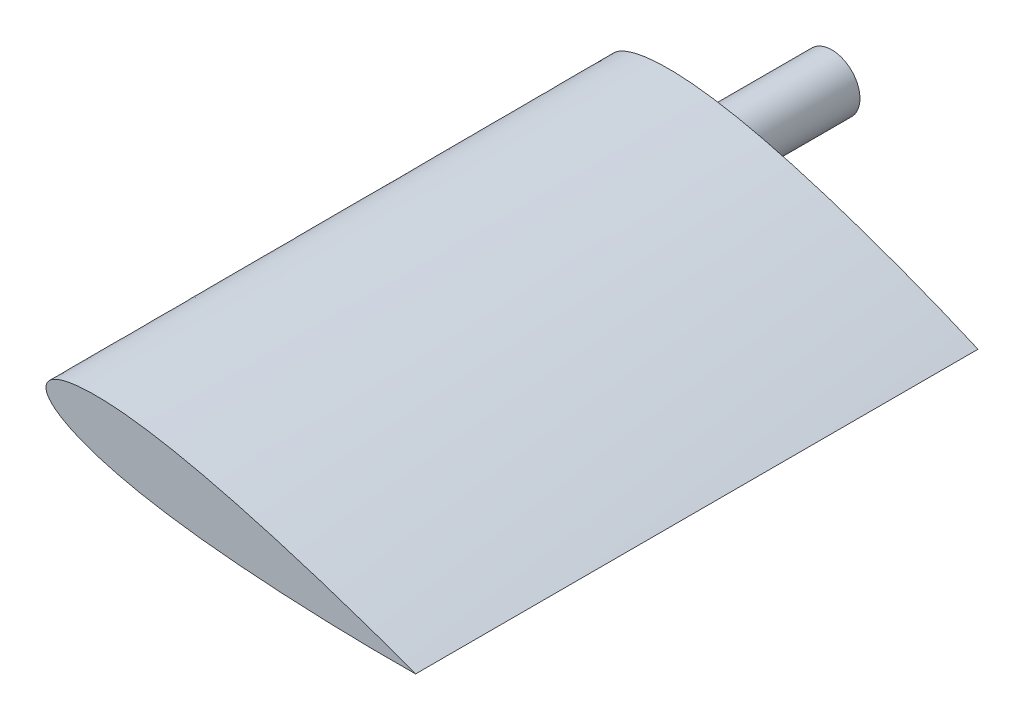
ISO-10303-21;
HEADER;
FILE_DESCRIPTION(('STEP AP214'),'2;1');
FILE_NAME('part.step','',(''),(''),'','','');
FILE_SCHEMA(('AUTOMOTIVE_DESIGN { 1 0 10303 214 1 1 1 1 }'));
ENDSEC;
DATA;
#1=APPLICATION_CONTEXT('core data for automotive mechanical design processes');
#2=APPLICATION_PROTOCOL_DEFINITION('international standard','automotive_design',2000,#1);
#3=PRODUCT_CONTEXT('',#1,'mechanical');
#4=PRODUCT('Part','Part','',(#3));
#5=PRODUCT_RELATED_PRODUCT_CATEGORY('part','',(#4));
#6=PRODUCT_DEFINITION_FORMATION('','',#4);
#7=PRODUCT_DEFINITION_CONTEXT('part definition',#1,'design');
#8=PRODUCT_DEFINITION('design','',#6,#7);
#9=PRODUCT_DEFINITION_SHAPE('','',#8);
#10=(LENGTH_UNIT() NAMED_UNIT(*) SI_UNIT(.MILLI.,.METRE.));
#11=(NAMED_UNIT(*) PLANE_ANGLE_UNIT() SI_UNIT($,.RADIAN.));
#12=(NAMED_UNIT(*) SI_UNIT($,.STERADIAN.) SOLID_ANGLE_UNIT());
#13=UNCERTAINTY_MEASURE_WITH_UNIT(LENGTH_MEASURE(1.E-05),#10,'distance_accuracy_value','');
#14=(GEOMETRIC_REPRESENTATION_CONTEXT(3) GLOBAL_UNCERTAINTY_ASSIGNED_CONTEXT((#13)) GLOBAL_UNIT_ASSIGNED_CONTEXT((#10,
#11,#12)) REPRESENTATION_CONTEXT('',''));
#15=CARTESIAN_POINT('',(0.,0.,0.));
#16=DIRECTION('',(0.,0.,1.));
#17=DIRECTION('',(1.,0.,0.));
#18=AXIS2_PLACEMENT_3D('',#15,#16,#17);
#19=CARTESIAN_POINT('',(313.547400110692,-57.174394458931,0.));
#20=DIRECTION('',(0.,0.,-1.));
#21=DIRECTION('',(-0.984807753012208,0.173648177666931,0.));
#22=AXIS2_PLACEMENT_3D('',#19,#20,#21);
#23=PLANE('',#22);
#24=CARTESIAN_POINT('',(202.028157373327,23.1819604238643,0.));
#25=DIRECTION('',(0.,0.,-1.));
#26=DIRECTION('',(-0.984807753012208,0.173648177666931,0.));
#27=AXIS2_PLACEMENT_3D('',#24,#25,#26);
#28=CIRCLE('',#27,50.);
#29=CARTESIAN_POINT('',(152.787769722716,31.8643693072108,0.));
#30=VERTEX_POINT('',#29);
#31=EDGE_CURVE('E96',#30,#30,#28,.T.);
#32=ORIENTED_EDGE('',*,*,#31,.F.);
#33=EDGE_LOOP('',(#32));
#34=FACE_BOUND('',#33,.T.);
#35=CARTESIAN_POINT('',(5.0666067708914,57.9115959572867,0.));
#36=CARTESIAN_POINT('',(4.75000358816037,56.1204386306563,0.));
#37=CARTESIAN_POINT('',(4.45652546687087,52.489358454994,0.));
#38=CARTESIAN_POINT('',(5.05191566782038,47.0479784036478,0.));
#39=CARTESIAN_POINT('',(6.58340072404875,41.8028813902483,0.));
#40=CARTESIAN_POINT('',(8.87244931250566,36.8457455571666,0.));
#41=CARTESIAN_POINT('',(11.7457186136554,32.2080177348289,0.));
#42=CARTESIAN_POINT('',(15.0641341744214,27.8817430967198,0.));
#43=CARTESIAN_POINT('',(18.7188700505766,23.8389440245324,0.));
#44=CARTESIAN_POINT('',(22.642947629858,20.0525926434712,0.));
#45=CARTESIAN_POINT('',(26.7693883000024,16.4956610787409,0.));
#46=CARTESIAN_POINT('',(31.0650945500276,13.1445234240756,0.));
#47=CARTESIAN_POINT('',(35.4969688689515,9.97555377320941,0.));
#48=CARTESIAN_POINT('',(41.5595930737063,5.97173158064968,0.));
#49=CARTESIAN_POINT('',(49.3729223306139,1.34204886268438,0.));
#50=CARTESIAN_POINT('',(59.0277387937009,-3.71320136850407,0.));
#51=CARTESIAN_POINT('',(68.8941626666754,-8.33849155951117,0.));
#52=CARTESIAN_POINT('',(78.926828422375,-12.5910864328743,0.));
#53=CARTESIAN_POINT('',(89.091490855078,-16.5145508241901,0.));
#54=CARTESIAN_POINT('',(99.36536626331,-20.144120040309,0.));
#55=CARTESIAN_POINT('',(109.727606901045,-23.5094518071365,0.));
#56=CARTESIAN_POINT('',(120.166014121485,-26.6347820025642,0.));
#57=CARTESIAN_POINT('',(130.665295789642,-29.5407678607339,0.));
#58=CARTESIAN_POINT('',(141.221494854735,-32.2462376955715,0.));
#59=CARTESIAN_POINT('',(151.820273064177,-34.7664293469896,0.));
#60=CARTESIAN_POINT('',(162.457997897433,-37.1146974894133,0.));
#61=CARTESIAN_POINT('',(173.131036833968,-39.3043967972676,0.));
#62=CARTESIAN_POINT('',(187.401516942255,-42.0263580509416,0.));
#63=CARTESIAN_POINT('',(205.300437542814,-45.084089866463,0.));
#64=CARTESIAN_POINT('',(226.857296262129,-48.2716417544606,0.));
#65=CARTESIAN_POINT('',(248.471659173799,-51.0336902977323,0.));
#66=CARTESIAN_POINT('',(270.131103449499,-53.4194991857202,0.));
#67=CARTESIAN_POINT('',(291.824461267508,-55.4696073332529,0.));
#68=CARTESIAN_POINT('',(313.544094756513,-57.219514984784,0.));
#69=CARTESIAN_POINT('',(335.283636317038,-58.6986798757468,0.));
#70=CARTESIAN_POINT('',(357.038650149282,-59.932538943737,0.));
#71=CARTESIAN_POINT('',(378.804794627028,-60.9424564549858,0.));
#72=CARTESIAN_POINT('',(400.580067973628,-61.7461325424527,0.));
#73=CARTESIAN_POINT('',(422.360458385054,-62.3580469133347,0.));
#74=CARTESIAN_POINT('',(444.147271263891,-62.7897434644158,0.));
#75=CARTESIAN_POINT('',(465.932743404275,-63.0499693131686,0.));
#76=CARTESIAN_POINT('',(487.726865329098,-63.144788310054,0.));
#77=CARTESIAN_POINT('',(509.50774249008,-63.078216835237,0.));
#78=CARTESIAN_POINT('',(531.312978943719,-62.8509884427372,0.));
#79=CARTESIAN_POINT('',(553.068432347847,-62.4639425472107,0.));
#80=CARTESIAN_POINT('',(574.909251200701,-61.9108163534676,0.));
#81=CARTESIAN_POINT('',(592.969226873889,-61.3135674524085,0.));
#82=CARTESIAN_POINT('',(607.548218071428,-60.7440668272987,0.));
#83=CARTESIAN_POINT('',(618.428042725409,-60.2731604246947,0.));
#84=CARTESIAN_POINT('',(629.269024010586,-59.759498376123,0.));
#85=CARTESIAN_POINT('',(640.256906166686,-59.1893860031201,0.));
#86=CARTESIAN_POINT('',(650.846693638105,-58.5953215211944,0.));
#87=CARTESIAN_POINT('',(658.634994095804,-58.1202704883738,0.));
#88=CARTESIAN_POINT('',(661.933378030041,-57.9117385465572,0.));
#89=B_SPLINE_CURVE_WITH_KNOTS('',3,(#35,#36,#37,#38,#39,#40,#41,#42,#43,#44,#45,#46,#47,#48,#49,
#50,#51,#52,#53,#54,#55,#56,#57,#58,#59,#60,#61,#62,#63,#64,#65,#66,#67,#68,#69,#70,#71,#72,#73,
#74,#75,#76,#77,#78,#79,#80,#81,#82,#83,#84,#85,#86,#87,#88),.UNSPECIFIED.,.F.,.F.,(4,1,1,1,1,1,
1,1,1,1,1,1,1,1,1,1,1,1,1,1,1,1,1,1,1,1,1,1,1,1,1,1,1,1,1,1,1,1,1,1,1,1,1,1,1,1,1,1,1,1,1,4),
(0.,0.0078125,0.015625,0.0234375,0.03125,0.0390625,0.046875,0.0546875,0.0625,0.0703125,0.078125,
0.0859375,0.09375,0.109375,0.125,0.140625,0.15625,0.171875,0.1875,0.203125,0.21875,0.234375,
0.25,0.265625,0.28125,0.296875,0.3125,0.34375,0.375,0.40625,0.4375,0.46875,0.5,0.53125,0.5625,
0.59375,0.625,0.65625,0.6875,0.71875,0.75,0.78125,0.8125,0.84375,0.875,0.90625,0.921875,0.9375,
0.953125,0.96875,0.984375,1.),.UNSPECIFIED.);
#90=CARTESIAN_POINT('',(5.0666067708914,57.9115959572867,0.));
#91=VERTEX_POINT('',#90);
#92=CARTESIAN_POINT('',(661.933378030041,-57.9117385465573,0.));
#93=VERTEX_POINT('',#92);
#94=EDGE_CURVE('E48',#91,#93,#89,.T.);
#95=ORIENTED_EDGE('',*,*,#94,.F.);
#96=CARTESIAN_POINT('',(661.933378030041,-57.9117385465574,0.));
#97=CARTESIAN_POINT('',(658.905233111148,-56.5876688737035,0.));
#98=CARTESIAN_POINT('',(651.749149836963,-53.4775328355619,0.));
#99=CARTESIAN_POINT('',(642.001044636683,-49.2973108025141,0.));
#100=CARTESIAN_POINT('',(631.871067754876,-45.0036212639001,0.));
#101=CARTESIAN_POINT('',(621.859120861425,-40.812906323977,0.));
#102=CARTESIAN_POINT('',(611.796786641441,-36.6494308175617,0.));
#103=CARTESIAN_POINT('',(598.297761062526,-31.1303487892266,0.));
#104=CARTESIAN_POINT('',(581.521814668085,-24.3884729093357,0.));
#105=CARTESIAN_POINT('',(561.192347333142,-16.4006977086737,0.));
#106=CARTESIAN_POINT('',(540.878796691945,-8.59521050167727,0.));
#107=CARTESIAN_POINT('',(520.467631270086,-0.924376775729138,0.));
#108=CARTESIAN_POINT('',(500.02237908007,6.58794532575718,0.));
#109=CARTESIAN_POINT('',(479.51054541612,13.9527314489505,0.));
#110=CARTESIAN_POINT('',(458.949683813102,21.1593493613073,0.));
#111=CARTESIAN_POINT('',(438.329240178968,28.2051741644773,0.));
#112=CARTESIAN_POINT('',(417.653022415049,35.0795166119824,0.));
#113=CARTESIAN_POINT('',(396.916113870649,41.7718798142035,0.));
#114=CARTESIAN_POINT('',(376.117201782436,48.2673329569814,0.));
#115=CARTESIAN_POINT('',(355.252178058308,54.5485350466229,0.));
#116=CARTESIAN_POINT('',(334.317785172344,60.5939368342467,0.));
#117=CARTESIAN_POINT('',(313.309500165218,66.3781137750711,0.));
#118=CARTESIAN_POINT('',(292.223240103197,71.8712065887761,0.));
#119=CARTESIAN_POINT('',(271.054012584372,77.0372480125403,0.));
#120=CARTESIAN_POINT('',(249.798501286547,81.8343151717546,0.));
#121=CARTESIAN_POINT('',(228.451433472985,86.2118823785855,0.));
#122=CARTESIAN_POINT('',(210.586204835438,89.460336770899,0.));
#123=CARTESIAN_POINT('',(196.245315048761,91.7833294208047,0.));
#124=CARTESIAN_POINT('',(185.467004350258,93.3760816985508,0.));
#125=CARTESIAN_POINT('',(174.667760373085,94.807734988903,0.));
#126=CARTESIAN_POINT('',(163.84627234899,96.064517607242,0.));
#127=CARTESIAN_POINT('',(153.00122950972,97.1326578689485,0.));
#128=CARTESIAN_POINT('',(142.14123179814,97.9928868266018,0.));
#129=CARTESIAN_POINT('',(131.263417267642,98.6261837870455,0.));
#130=CARTESIAN_POINT('',(120.375081156826,99.0079010011392,0.));
#131=CARTESIAN_POINT('',(109.479411909787,99.1110937642083,0.));
#132=CARTESIAN_POINT('',(98.5858502812969,98.900763331233,0.));
#133=CARTESIAN_POINT('',(87.7037527324175,98.3360034249447,0.));
#134=CARTESIAN_POINT('',(76.8504093734222,97.3641709409924,0.));
#135=CARTESIAN_POINT('',(66.0488435824164,95.9159262636465,0.));
#136=CARTESIAN_POINT('',(57.1232841308992,94.2377712352842,0.));
#137=CARTESIAN_POINT('',(50.0568814736145,92.5489419196226,0.));
#138=CARTESIAN_POINT('',(44.808426632338,91.0868726021018,0.));
#139=CARTESIAN_POINT('',(39.6256436424708,89.4070612695175,0.));
#140=CARTESIAN_POINT('',(34.5315225741959,87.4759688438606,0.));
#141=CARTESIAN_POINT('',(29.5490534976958,85.260056247122,0.));
#142=CARTESIAN_POINT('',(24.7319840198536,82.7110480275987,0.));
#143=CARTESIAN_POINT('',(20.1340617475523,79.7806687335877,0.));
#144=CARTESIAN_POINT('',(15.8478756911072,76.4053462498434,0.));
#145=CARTESIAN_POINT('',(12.0014305862001,72.530061418261,0.));
#146=CARTESIAN_POINT('',(8.76837836986703,68.1250822620825,0.));
#147=CARTESIAN_POINT('',(6.34783196257009,63.215492413179,0.));
#148=CARTESIAN_POINT('',(5.38170898193466,59.7030179457229,0.));
#149=CARTESIAN_POINT('',(5.0666067708914,57.9115959572867,0.));
#150=B_SPLINE_CURVE_WITH_KNOTS('',3,(#96,#97,#98,#99,#100,#101,#102,#103,#104,#105,#106,#107,
#108,#109,#110,#111,#112,#113,#114,#115,#116,#117,#118,#119,#120,#121,#122,#123,#124,#125,#126,
#127,#128,#129,#130,#131,#132,#133,#134,#135,#136,#137,#138,#139,#140,#141,#142,#143,#144,#145,
#146,#147,#148,#149),.UNSPECIFIED.,.F.,.F.,(4,1,1,1,1,1,1,1,1,1,1,1,1,1,1,1,1,1,1,1,1,1,1,1,1,1,
1,1,1,1,1,1,1,1,1,1,1,1,1,1,1,1,1,1,1,1,1,1,1,1,1,4),(0.,0.015625,0.03125,0.046875,0.0625,
0.078125,0.09375,0.125,0.15625,0.1875,0.21875,0.25,0.28125,0.3125,0.34375,0.375,0.40625,0.4375,
0.46875,0.5,0.53125,0.5625,0.59375,0.625,0.65625,0.6875,0.703125,0.71875,0.734375,0.75,0.765625,
0.78125,0.796875,0.8125,0.828125,0.84375,0.859375,0.875,0.890625,0.90625,0.9140625,0.921875,
0.9296875,0.9375,0.9453125,0.953125,0.9609375,0.96875,0.9765625,0.984375,0.9921875,1.),.UNSPECIFIED.);
#151=EDGE_CURVE('E84',#93,#91,#150,.T.);
#152=ORIENTED_EDGE('',*,*,#151,.F.);
#153=EDGE_LOOP('',(#95,#152));
#154=FACE_BOUND('',#153,.T.);
#155=ADVANCED_FACE('F37',(#34,#154),#23,.T.);
#156=CARTESIAN_POINT('',(334.822903031977,46.8748549191227,1000.));
#157=DIRECTION('',(0.,0.,1.));
#158=DIRECTION('',(0.984807753012208,-0.173648177666931,0.));
#159=AXIS2_PLACEMENT_3D('',#156,#157,#158);
#160=PLANE('',#159);
#161=CARTESIAN_POINT('',(5.0666067708914,57.9115959572867,1000.));
#162=CARTESIAN_POINT('',(5.37754348898111,59.6782616089753,1000.));
#163=CARTESIAN_POINT('',(6.54457274764009,63.099366468273,1000.));
#164=CARTESIAN_POINT('',(9.69192621921696,67.5119078845999,1000.));
#165=CARTESIAN_POINT('',(13.7074131244409,71.1057061804863,1000.));
#166=CARTESIAN_POINT('',(18.2271238703297,74.0280456713926,1000.));
#167=CARTESIAN_POINT('',(23.0408510216387,76.4183549872879,999.999999999998));
#168=CARTESIAN_POINT('',(28.0371152497141,78.3959874878238,1000.));
#169=CARTESIAN_POINT('',(33.1493783399715,80.0427565753955,999.999999999998));
#170=CARTESIAN_POINT('',(38.3410069962354,81.4201960997255,1000.));
#171=CARTESIAN_POINT('',(43.585449729711,82.5733715739832,1000.));
#172=CARTESIAN_POINT('',(48.8691835754783,83.53555845265,1000.));
#173=CARTESIAN_POINT('',(54.1785332954408,84.332999843943,999.999999999998));
#174=CARTESIAN_POINT('',(61.2871703170687,85.2049577248262,1000.));
#175=CARTESIAN_POINT('',(70.201470615224,85.9749063390662,999.999999999997));
#176=CARTESIAN_POINT('',(80.9320941615837,86.4879469737474,1000.));
#177=CARTESIAN_POINT('',(91.6684602982473,86.6580758186161,999.999999999998));
#178=CARTESIAN_POINT('',(102.408152817854,86.5328254534112,1000.));
#179=CARTESIAN_POINT('',(113.140178058229,86.152125610136,999.999999999997));
#180=CARTESIAN_POINT('',(123.862213186172,85.5462365469838,1000.));
#181=CARTESIAN_POINT('',(134.57053555563,84.7383936058303,1000.));
#182=CARTESIAN_POINT('',(145.263813863425,83.748805552876,999.999999999999));
#183=CARTESIAN_POINT('',(155.940386724798,82.5944834983454,1000.));
#184=CARTESIAN_POINT('',(166.599598365433,81.2900168591991,999.999999999998));
#185=CARTESIAN_POINT('',(177.240886815279,79.8476353003351,1000.));
#186=CARTESIAN_POINT('',(187.864237695605,78.2777645872348,1000.));
#187=CARTESIAN_POINT('',(198.469424336847,76.5901688791361,1000.));
#188=CARTESIAN_POINT('',(212.585927932346,74.1942983097761,1000.));
#189=CARTESIAN_POINT('',(230.186670798578,70.9462356825272,999.999999999998));
#190=CARTESIAN_POINT('',(251.239398527471,66.6942894726631,1000.));
#191=CARTESIAN_POINT('',(272.226515800981,62.1313734401402,999.999999999998));
#192=CARTESIAN_POINT('',(293.151943515036,57.293217361565,1000.));
#193=CARTESIAN_POINT('',(314.019028217547,52.2101220486109,999.999999999999));
#194=CARTESIAN_POINT('',(334.831486034274,46.9077952110858,1000.));
#195=CARTESIAN_POINT('',(355.592479066938,41.4078045794249,1000.));
#196=CARTESIAN_POINT('',(376.305303831948,35.7287754410724,1000.));
#197=CARTESIAN_POINT('',(396.972241964204,29.8861240175743,1000.));
#198=CARTESIAN_POINT('',(417.596500337917,23.8925128426129,1000.));
#199=CARTESIAN_POINT('',(438.178317130242,17.758977403618,1000.));
#200=CARTESIAN_POINT('',(458.722733930273,11.4926267062237,999.999999999999));
#201=CARTESIAN_POINT('',(479.223527776576,5.10223205846632,1000.));
#202=CARTESIAN_POINT('',(499.695406912562,-1.4125630492522,1000.));
#203=CARTESIAN_POINT('',(520.111494313864,-8.03991190450893,1000.));
#204=CARTESIAN_POINT('',(540.521094751535,-14.7958544520778,1000.));
#205=CARTESIAN_POINT('',(560.831745979992,-21.649291587711,999.999999999998));
#206=CARTESIAN_POINT('',(581.212775392702,-28.661932012255,1000.));
#207=CARTESIAN_POINT('',(597.99662226203,-34.5507037010961,1000.));
#208=CARTESIAN_POINT('',(611.577897513671,-39.3892497337176,1000.));
#209=CARTESIAN_POINT('',(621.714644024533,-43.0374463885277,1000.));
#210=CARTESIAN_POINT('',(631.675871801569,-46.6604529632512,1000.));
#211=CARTESIAN_POINT('',(641.909672886673,-50.4224381139671,1000.));
#212=CARTESIAN_POINT('',(651.668438093353,-54.0475897316778,1000.));
#213=CARTESIAN_POINT('',(658.886645268179,-56.7604639588637,1000.));
#214=CARTESIAN_POINT('',(661.933378024284,-57.9117385455422,1000.));
#215=B_SPLINE_CURVE_WITH_KNOTS('',3,(#161,#162,#163,#164,#165,#166,#167,#168,#169,#170,#171,
#172,#173,#174,#175,#176,#177,#178,#179,#180,#181,#182,#183,#184,#185,#186,#187,#188,#189,#190,
#191,#192,#193,#194,#195,#196,#197,#198,#199,#200,#201,#202,#203,#204,#205,#206,#207,#208,#209,
#210,#211,#212,#213,#214),.UNSPECIFIED.,.F.,.F.,(4,1,1,1,1,1,1,1,1,1,1,1,1,1,1,1,1,1,1,1,1,1,1,
1,1,1,1,1,1,1,1,1,1,1,1,1,1,1,1,1,1,1,1,1,1,1,1,1,1,1,1,4),(0.,0.0078125,0.015625,0.0234375,
0.03125,0.0390625,0.046875,0.0546875,0.0625,0.0703125,0.078125,0.0859375,0.09375,0.109375,0.125,
0.140625,0.15625,0.171875,0.1875,0.203125,0.21875,0.234375,0.25,0.265625,0.28125,0.296875,
0.3125,0.34375,0.375,0.40625,0.4375,0.46875,0.5,0.53125,0.5625,0.59375,0.625,0.65625,0.6875,
0.71875,0.75,0.78125,0.8125,0.84375,0.875,0.90625,0.921875,0.9375,0.953125,0.96875,0.984375,1.),.UNSPECIFIED.);
#216=CARTESIAN_POINT('',(5.0666067708914,57.9115959572867,1000.));
#217=VERTEX_POINT('',#216);
#218=CARTESIAN_POINT('',(661.933378025822,-57.9117385458135,1000.));
#219=VERTEX_POINT('',#218);
#220=EDGE_CURVE('E65',#217,#219,#215,.T.);
#221=ORIENTED_EDGE('',*,*,#220,.F.);
#222=CARTESIAN_POINT('',(661.93337802813,-57.9117385462204,1000.));
#223=CARTESIAN_POINT('',(658.676626638196,-57.9515388059335,1000.));
#224=CARTESIAN_POINT('',(650.966220138184,-58.032024967867,999.999999999999));
#225=CARTESIAN_POINT('',(640.555267833935,-58.1008851323509,1000.));
#226=CARTESIAN_POINT('',(629.652009214662,-58.1357853283738,999.999999999998));
#227=CARTESIAN_POINT('',(619.063574750284,-58.1334277202994,1000.));
#228=CARTESIAN_POINT('',(608.28510578791,-58.0946139375882,1000.));
#229=CARTESIAN_POINT('',(593.856539640323,-57.9962329975706,999.999999999998));
#230=CARTESIAN_POINT('',(576.081139959245,-57.7895376476306,1000.));
#231=CARTESIAN_POINT('',(554.524025381807,-57.4084665597349,999.999999999999));
#232=CARTESIAN_POINT('',(533.097835565476,-56.9019885702325,1000.));
#233=CARTESIAN_POINT('',(511.606535254776,-56.2699720489387,1000.));
#234=CARTESIAN_POINT('',(490.156065504634,-55.5149507033195,999.999999999999));
#235=CARTESIAN_POINT('',(468.690044192619,-54.6350479262767,1000.));
#236=CARTESIAN_POINT('',(447.240249415238,-53.6283777148274,1000.));
#237=CARTESIAN_POINT('',(425.791441924407,-52.4902124768613,1000.));
#238=CARTESIAN_POINT('',(404.353138765472,-51.2144567976064,1000.));
#239=CARTESIAN_POINT('',(382.92270353019,-49.7926959102043,1000.));
#240=CARTESIAN_POINT('',(361.503848960251,-48.2144839375619,999.999999999999));
#241=CARTESIAN_POINT('',(340.097807990972,-46.4668220120176,1000.));
#242=CARTESIAN_POINT('',(318.707753271907,-44.5344449865169,999.999999999999));
#243=CARTESIAN_POINT('',(297.336935914113,-42.398722574199,1000.));
#244=CARTESIAN_POINT('',(275.989769350897,-40.0383062930459,999.999999999997));
#245=CARTESIAN_POINT('',(254.671554411471,-37.4277684282938,1000.));
#246=CARTESIAN_POINT('',(233.389501515258,-34.5374893553936,1000.));
#247=CARTESIAN_POINT('',(212.152166840881,-31.3325564547936,1000.));
#248=CARTESIAN_POINT('',(194.501958870538,-28.3649254540492,1000.));
#249=CARTESIAN_POINT('',(180.417360572385,-25.7881808001182,999.999999999998));
#250=CARTESIAN_POINT('',(169.874551227378,-23.7468142569845,1000.));
#251=CARTESIAN_POINT('',(159.354940249869,-21.58861038027,999.999999999999));
#252=CARTESIAN_POINT('',(148.862075726405,-19.304470430306,1000.));
#253=CARTESIAN_POINT('',(138.399540361646,-16.884603462372,999.999999999998));
#254=CARTESIAN_POINT('',(127.972040454038,-14.3177075489461,1000.));
#255=CARTESIAN_POINT('',(117.585190052864,-11.5903012074306,999.999999999998));
#256=CARTESIAN_POINT('',(107.246353892147,-8.68696030307366,1000.));
#257=CARTESIAN_POINT('',(96.9637210890474,-5.58916310467972,1000.));
#258=CARTESIAN_POINT('',(86.7486891668877,-2.27632524994955,1000.));
#259=CARTESIAN_POINT('',(76.6138786677682,1.2791505624707,1000.));
#260=CARTESIAN_POINT('',(66.5831142289524,5.11110643548363,1000.));
#261=CARTESIAN_POINT('',(56.675214703255,9.26323799608002,1000.));
#262=CARTESIAN_POINT('',(48.5616573707641,13.0357187391038,999.999999999999));
#263=CARTESIAN_POINT('',(42.1800646687062,16.2863318739439,1000.));
#264=CARTESIAN_POINT('',(37.4636626669951,18.851579424083,999.999999999999));
#265=CARTESIAN_POINT('',(32.8276496727942,21.5628899532181,1000.));
#266=CARTESIAN_POINT('',(28.2939033170467,24.4402212688192,999.999999999997));
#267=CARTESIAN_POINT('',(23.8864758417397,27.5102347788366,1000.00000000001));
#268=CARTESIAN_POINT('',(19.6457503232438,30.8061874135579,999.999999999992));
#269=CARTESIAN_POINT('',(15.6271867037202,34.3733776541654,1000.00000000001));
#270=CARTESIAN_POINT('',(11.9212973157724,38.265925053094,999.999999999993));
#271=CARTESIAN_POINT('',(8.67365717243992,42.5578581631422,1000.00000000001));
#272=CARTESIAN_POINT('',(6.12948531577856,47.308301235646,999.999999999996));
#273=CARTESIAN_POINT('',(4.68111845194226,52.5311921681142,1000.));
#274=CARTESIAN_POINT('',(4.75455647101064,56.145126660113,1000.));
#275=CARTESIAN_POINT('',(5.0666067708914,57.9115959572867,1000.));
#276=B_SPLINE_CURVE_WITH_KNOTS('',3,(#222,#223,#224,#225,#226,#227,#228,#229,#230,#231,#232,
#233,#234,#235,#236,#237,#238,#239,#240,#241,#242,#243,#244,#245,#246,#247,#248,#249,#250,#251,
#252,#253,#254,#255,#256,#257,#258,#259,#260,#261,#262,#263,#264,#265,#266,#267,#268,#269,#270,
#271,#272,#273,#274,#275),.UNSPECIFIED.,.F.,.F.,(4,1,1,1,1,1,1,1,1,1,1,1,1,1,1,1,1,1,1,1,1,1,1,
1,1,1,1,1,1,1,1,1,1,1,1,1,1,1,1,1,1,1,1,1,1,1,1,1,1,1,1,4),(0.,0.015625,0.03125,0.046875,0.0625,
0.078125,0.09375,0.125,0.15625,0.1875,0.21875,0.25,0.28125,0.3125,0.34375,0.375,0.40625,0.4375,
0.46875,0.5,0.53125,0.5625,0.59375,0.625,0.65625,0.6875,0.703125,0.71875,0.734375,0.75,0.765625,
0.78125,0.796875,0.8125,0.828125,0.84375,0.859375,0.875,0.890625,0.90625,0.9140625,0.921875,
0.9296875,0.9375,0.9453125,0.953125,0.9609375,0.96875,0.9765625,0.984375,0.9921875,1.),.UNSPECIFIED.);
#277=EDGE_CURVE('E11',#219,#217,#276,.T.);
#278=ORIENTED_EDGE('',*,*,#277,.F.);
#279=EDGE_LOOP('',(#221,#278));
#280=FACE_BOUND('',#279,.T.);
#281=ADVANCED_FACE('F64',(#280),#160,.T.);
#282=CARTESIAN_POINT('',(661.93337802813,-57.9117385462204,1000.));
#283=CARTESIAN_POINT('',(661.933378030041,-57.9117385465572,0.));
#284=CARTESIAN_POINT('',(658.676626638196,-57.9515388059335,1000.));
#285=CARTESIAN_POINT('',(658.634994095804,-58.1202704883738,0.));
#286=CARTESIAN_POINT('',(650.966220138184,-58.032024967867,999.999999999999));
#287=CARTESIAN_POINT('',(650.846693638105,-58.5953215211944,0.));
#288=CARTESIAN_POINT('',(640.555267833935,-58.1008851323509,1000.));
#289=CARTESIAN_POINT('',(640.256906166686,-59.1893860031201,0.));
#290=CARTESIAN_POINT('',(629.652009214662,-58.1357853283738,999.999999999998));
#291=CARTESIAN_POINT('',(629.269024010586,-59.759498376123,0.));
#292=CARTESIAN_POINT('',(619.063574750284,-58.1334277202994,1000.));
#293=CARTESIAN_POINT('',(618.428042725409,-60.2731604246947,0.));
#294=CARTESIAN_POINT('',(608.28510578791,-58.0946139375882,1000.));
#295=CARTESIAN_POINT('',(607.548218071428,-60.7440668272987,0.));
#296=CARTESIAN_POINT('',(593.856539640323,-57.9962329975706,999.999999999998));
#297=CARTESIAN_POINT('',(592.969226873889,-61.3135674524085,0.));
#298=CARTESIAN_POINT('',(576.081139959245,-57.7895376476306,1000.));
#299=CARTESIAN_POINT('',(574.909251200701,-61.9108163534676,0.));
#300=CARTESIAN_POINT('',(554.524025381807,-57.4084665597349,999.999999999999));
#301=CARTESIAN_POINT('',(553.068432347847,-62.4639425472107,0.));
#302=CARTESIAN_POINT('',(533.097835565476,-56.9019885702325,1000.));
#303=CARTESIAN_POINT('',(531.312978943719,-62.8509884427372,0.));
#304=CARTESIAN_POINT('',(511.606535254776,-56.2699720489387,1000.));
#305=CARTESIAN_POINT('',(509.50774249008,-63.078216835237,0.));
#306=CARTESIAN_POINT('',(490.156065504634,-55.5149507033195,999.999999999999));
#307=CARTESIAN_POINT('',(487.726865329098,-63.144788310054,0.));
#308=CARTESIAN_POINT('',(468.690044192619,-54.6350479262767,1000.));
#309=CARTESIAN_POINT('',(465.932743404275,-63.0499693131686,0.));
#310=CARTESIAN_POINT('',(447.240249415238,-53.6283777148274,1000.));
#311=CARTESIAN_POINT('',(444.147271263891,-62.7897434644158,0.));
#312=CARTESIAN_POINT('',(425.791441924407,-52.4902124768613,1000.));
#313=CARTESIAN_POINT('',(422.360458385054,-62.3580469133347,0.));
#314=CARTESIAN_POINT('',(404.353138765472,-51.2144567976064,1000.));
#315=CARTESIAN_POINT('',(400.580067973628,-61.7461325424527,0.));
#316=CARTESIAN_POINT('',(382.92270353019,-49.7926959102043,1000.));
#317=CARTESIAN_POINT('',(378.804794627028,-60.9424564549858,0.));
#318=CARTESIAN_POINT('',(361.503848960251,-48.2144839375619,999.999999999999));
#319=CARTESIAN_POINT('',(357.038650149282,-59.932538943737,0.));
#320=CARTESIAN_POINT('',(340.097807990972,-46.4668220120176,1000.));
#321=CARTESIAN_POINT('',(335.283636317038,-58.6986798757468,0.));
#322=CARTESIAN_POINT('',(318.707753271907,-44.5344449865169,999.999999999999));
#323=CARTESIAN_POINT('',(313.544094756513,-57.219514984784,0.));
#324=CARTESIAN_POINT('',(297.336935914113,-42.398722574199,1000.));
#325=CARTESIAN_POINT('',(291.824461267508,-55.4696073332529,0.));
#326=CARTESIAN_POINT('',(275.989769350897,-40.0383062930459,999.999999999997));
#327=CARTESIAN_POINT('',(270.131103449499,-53.4194991857202,0.));
#328=CARTESIAN_POINT('',(254.671554411471,-37.4277684282938,1000.));
#329=CARTESIAN_POINT('',(248.471659173799,-51.0336902977323,0.));
#330=CARTESIAN_POINT('',(233.389501515258,-34.5374893553936,1000.));
#331=CARTESIAN_POINT('',(226.857296262129,-48.2716417544606,0.));
#332=CARTESIAN_POINT('',(212.152166840881,-31.3325564547936,1000.));
#333=CARTESIAN_POINT('',(205.300437542814,-45.084089866463,0.));
#334=CARTESIAN_POINT('',(194.501958870538,-28.3649254540492,1000.));
#335=CARTESIAN_POINT('',(187.401516942255,-42.0263580509416,0.));
#336=CARTESIAN_POINT('',(180.417360572385,-25.7881808001182,999.999999999998));
#337=CARTESIAN_POINT('',(173.131036833968,-39.3043967972676,0.));
#338=CARTESIAN_POINT('',(169.874551227378,-23.7468142569845,1000.));
#339=CARTESIAN_POINT('',(162.457997897433,-37.1146974894133,0.));
#340=CARTESIAN_POINT('',(159.354940249869,-21.58861038027,999.999999999999));
#341=CARTESIAN_POINT('',(151.820273064177,-34.7664293469896,0.));
#342=CARTESIAN_POINT('',(148.862075726405,-19.304470430306,1000.));
#343=CARTESIAN_POINT('',(141.221494854735,-32.2462376955715,0.));
#344=CARTESIAN_POINT('',(138.399540361646,-16.884603462372,999.999999999998));
#345=CARTESIAN_POINT('',(130.665295789642,-29.5407678607339,0.));
#346=CARTESIAN_POINT('',(127.972040454038,-14.3177075489461,1000.));
#347=CARTESIAN_POINT('',(120.166014121485,-26.6347820025642,0.));
#348=CARTESIAN_POINT('',(117.585190052864,-11.5903012074306,999.999999999998));
#349=CARTESIAN_POINT('',(109.727606901045,-23.5094518071365,0.));
#350=CARTESIAN_POINT('',(107.246353892147,-8.68696030307366,1000.));
#351=CARTESIAN_POINT('',(99.36536626331,-20.144120040309,0.));
#352=CARTESIAN_POINT('',(96.9637210890474,-5.58916310467972,1000.));
#353=CARTESIAN_POINT('',(89.091490855078,-16.5145508241901,0.));
#354=CARTESIAN_POINT('',(86.7486891668877,-2.27632524994955,1000.));
#355=CARTESIAN_POINT('',(78.926828422375,-12.5910864328743,0.));
#356=CARTESIAN_POINT('',(76.6138786677682,1.2791505624707,1000.));
#357=CARTESIAN_POINT('',(68.8941626666754,-8.33849155951117,0.));
#358=CARTESIAN_POINT('',(66.5831142289524,5.11110643548363,1000.));
#359=CARTESIAN_POINT('',(59.0277387937009,-3.71320136850407,0.));
#360=CARTESIAN_POINT('',(56.675214703255,9.26323799608002,1000.));
#361=CARTESIAN_POINT('',(49.3729223306139,1.34204886268438,0.));
#362=CARTESIAN_POINT('',(48.5616573707641,13.0357187391038,999.999999999999));
#363=CARTESIAN_POINT('',(41.5595930737063,5.97173158064968,0.));
#364=CARTESIAN_POINT('',(42.1800646687062,16.2863318739439,1000.));
#365=CARTESIAN_POINT('',(35.4969688689515,9.97555377320941,0.));
#366=CARTESIAN_POINT('',(37.4636626669951,18.851579424083,999.999999999999));
#367=CARTESIAN_POINT('',(31.0650945500276,13.1445234240756,0.));
#368=CARTESIAN_POINT('',(32.8276496727942,21.5628899532181,1000.));
#369=CARTESIAN_POINT('',(26.7693883000024,16.4956610787409,0.));
#370=CARTESIAN_POINT('',(28.2939033170467,24.4402212688192,999.999999999997));
#371=CARTESIAN_POINT('',(22.642947629858,20.0525926434712,0.));
#372=CARTESIAN_POINT('',(23.8864758417397,27.5102347788366,1000.00000000001));
#373=CARTESIAN_POINT('',(18.7188700505766,23.8389440245324,0.));
#374=CARTESIAN_POINT('',(19.6457503232438,30.8061874135579,999.999999999992));
#375=CARTESIAN_POINT('',(15.0641341744214,27.8817430967198,0.));
#376=CARTESIAN_POINT('',(15.6271867037202,34.3733776541654,1000.00000000001));
#377=CARTESIAN_POINT('',(11.7457186136554,32.2080177348289,0.));
#378=CARTESIAN_POINT('',(11.9212973157724,38.265925053094,999.999999999993));
#379=CARTESIAN_POINT('',(8.87244931250566,36.8457455571666,0.));
#380=CARTESIAN_POINT('',(8.67365717243992,42.5578581631422,1000.00000000001));
#381=CARTESIAN_POINT('',(6.58340072404875,41.8028813902483,0.));
#382=CARTESIAN_POINT('',(6.12948531577856,47.308301235646,999.999999999996));
#383=CARTESIAN_POINT('',(5.05191566782038,47.0479784036478,0.));
#384=CARTESIAN_POINT('',(4.68111845194226,52.5311921681142,1000.));
#385=CARTESIAN_POINT('',(4.45652546687087,52.489358454994,0.));
#386=CARTESIAN_POINT('',(4.75455647101064,56.145126660113,1000.));
#387=CARTESIAN_POINT('',(4.75000358816037,56.1204386306563,0.));
#388=CARTESIAN_POINT('',(5.0666067708914,57.9115959572867,1000.));
#389=CARTESIAN_POINT('',(5.0666067708914,57.9115959572867,0.));
#390=B_SPLINE_SURFACE_WITH_KNOTS('',3,1,((#282,#283),(#284,#285),(#286,#287),(#288,#289),(#290,
#291),(#292,#293),(#294,#295),(#296,#297),(#298,#299),(#300,#301),(#302,#303),(#304,#305),(#306,
#307),(#308,#309),(#310,#311),(#312,#313),(#314,#315),(#316,#317),(#318,#319),(#320,#321),(#322,
#323),(#324,#325),(#326,#327),(#328,#329),(#330,#331),(#332,#333),(#334,#335),(#336,#337),(#338,
#339),(#340,#341),(#342,#343),(#344,#345),(#346,#347),(#348,#349),(#350,#351),(#352,#353),(#354,
#355),(#356,#357),(#358,#359),(#360,#361),(#362,#363),(#364,#365),(#366,#367),(#368,#369),(#370,
#371),(#372,#373),(#374,#375),(#376,#377),(#378,#379),(#380,#381),(#382,#383),(#384,#385),(#386,
#387),(#388,#389)),.UNSPECIFIED.,.F.,.F.,.F.,(4,1,1,1,1,1,1,1,1,1,1,1,1,1,1,1,1,1,1,1,1,1,1,1,1,
1,1,1,1,1,1,1,1,1,1,1,1,1,1,1,1,1,1,1,1,1,1,1,1,1,1,4),(2,2),(0.,0.015625,0.03125,0.046875,
0.0625,0.078125,0.09375,0.125,0.15625,0.1875,0.21875,0.25,0.28125,0.3125,0.34375,0.375,0.40625,
0.4375,0.46875,0.5,0.53125,0.5625,0.59375,0.625,0.65625,0.6875,0.703125,0.71875,0.734375,0.75,
0.765625,0.78125,0.796875,0.8125,0.828125,0.84375,0.859375,0.875,0.890625,0.90625,0.9140625,
0.921875,0.9296875,0.9375,0.9453125,0.953125,0.9609375,0.96875,0.9765625,0.984375,0.9921875,1.),
(0.,1.),.UNSPECIFIED.);
#391=DIRECTION('',(0.,0.,1.));
#392=VECTOR('',#391,1.);
#393=CARTESIAN_POINT('',(5.0666067708914,57.9115959572867,500.));
#394=LINE('',#393,#392);
#395=EDGE_CURVE('E79',#91,#217,#394,.T.);
#396=DIRECTION('',(5.75694211252323E-12,-1.01519687781624E-12,-1.));
#397=VECTOR('',#396,1.);
#398=CARTESIAN_POINT('',(661.933378027162,-57.9117385460498,500.));
#399=LINE('',#398,#397);
#400=EDGE_CURVE('E78',#219,#93,#399,.T.);
#401=ORIENTED_EDGE('',*,*,#277,.T.);
#402=ORIENTED_EDGE('',*,*,#395,.F.);
#403=ORIENTED_EDGE('',*,*,#94,.T.);
#404=ORIENTED_EDGE('',*,*,#400,.F.);
#405=EDGE_LOOP('',(#401,#402,#403,#404));
#406=FACE_BOUND('',#405,.T.);
#407=ADVANCED_FACE('F82',(#406),#390,.T.);
#408=CARTESIAN_POINT('',(5.0666067708914,57.9115959572867,1000.));
#409=CARTESIAN_POINT('',(5.0666067708914,57.9115959572867,0.));
#410=CARTESIAN_POINT('',(5.37754348898111,59.6782616089753,1000.));
#411=CARTESIAN_POINT('',(5.38170898193466,59.7030179457229,0.));
#412=CARTESIAN_POINT('',(6.54457274764009,63.099366468273,1000.));
#413=CARTESIAN_POINT('',(6.34783196257009,63.215492413179,0.));
#414=CARTESIAN_POINT('',(9.69192621921696,67.5119078845999,1000.));
#415=CARTESIAN_POINT('',(8.76837836986703,68.1250822620825,0.));
#416=CARTESIAN_POINT('',(13.7074131244409,71.1057061804863,1000.));
#417=CARTESIAN_POINT('',(12.0014305862001,72.530061418261,0.));
#418=CARTESIAN_POINT('',(18.2271238703297,74.0280456713926,1000.));
#419=CARTESIAN_POINT('',(15.8478756911072,76.4053462498434,0.));
#420=CARTESIAN_POINT('',(23.0408510216387,76.4183549872879,999.999999999998));
#421=CARTESIAN_POINT('',(20.1340617475523,79.7806687335877,0.));
#422=CARTESIAN_POINT('',(28.0371152497141,78.3959874878238,1000.));
#423=CARTESIAN_POINT('',(24.7319840198536,82.7110480275987,0.));
#424=CARTESIAN_POINT('',(33.1493783399715,80.0427565753955,999.999999999998));
#425=CARTESIAN_POINT('',(29.5490534976958,85.260056247122,0.));
#426=CARTESIAN_POINT('',(38.3410069962354,81.4201960997255,1000.));
#427=CARTESIAN_POINT('',(34.5315225741959,87.4759688438606,0.));
#428=CARTESIAN_POINT('',(43.585449729711,82.5733715739832,1000.));
#429=CARTESIAN_POINT('',(39.6256436424708,89.4070612695175,0.));
#430=CARTESIAN_POINT('',(48.8691835754783,83.53555845265,1000.));
#431=CARTESIAN_POINT('',(44.808426632338,91.0868726021018,0.));
#432=CARTESIAN_POINT('',(54.1785332954408,84.332999843943,999.999999999998));
#433=CARTESIAN_POINT('',(50.0568814736145,92.5489419196226,0.));
#434=CARTESIAN_POINT('',(61.2871703170687,85.2049577248262,1000.));
#435=CARTESIAN_POINT('',(57.1232841308992,94.2377712352842,0.));
#436=CARTESIAN_POINT('',(70.201470615224,85.9749063390662,999.999999999997));
#437=CARTESIAN_POINT('',(66.0488435824164,95.9159262636465,0.));
#438=CARTESIAN_POINT('',(80.9320941615837,86.4879469737474,1000.));
#439=CARTESIAN_POINT('',(76.8504093734222,97.3641709409924,0.));
#440=CARTESIAN_POINT('',(91.6684602982473,86.6580758186161,999.999999999998));
#441=CARTESIAN_POINT('',(87.7037527324175,98.3360034249447,0.));
#442=CARTESIAN_POINT('',(102.408152817854,86.5328254534112,1000.));
#443=CARTESIAN_POINT('',(98.5858502812969,98.900763331233,0.));
#444=CARTESIAN_POINT('',(113.140178058229,86.152125610136,999.999999999997));
#445=CARTESIAN_POINT('',(109.479411909787,99.1110937642083,0.));
#446=CARTESIAN_POINT('',(123.862213186172,85.5462365469838,1000.));
#447=CARTESIAN_POINT('',(120.375081156826,99.0079010011392,0.));
#448=CARTESIAN_POINT('',(134.57053555563,84.7383936058303,1000.));
#449=CARTESIAN_POINT('',(131.263417267642,98.6261837870455,0.));
#450=CARTESIAN_POINT('',(145.263813863425,83.748805552876,999.999999999999));
#451=CARTESIAN_POINT('',(142.14123179814,97.9928868266018,0.));
#452=CARTESIAN_POINT('',(155.940386724798,82.5944834983454,1000.));
#453=CARTESIAN_POINT('',(153.00122950972,97.1326578689485,0.));
#454=CARTESIAN_POINT('',(166.599598365433,81.2900168591991,999.999999999998));
#455=CARTESIAN_POINT('',(163.84627234899,96.064517607242,0.));
#456=CARTESIAN_POINT('',(177.240886815279,79.8476353003351,1000.));
#457=CARTESIAN_POINT('',(174.667760373085,94.807734988903,0.));
#458=CARTESIAN_POINT('',(187.864237695605,78.2777645872348,1000.));
#459=CARTESIAN_POINT('',(185.467004350258,93.3760816985508,0.));
#460=CARTESIAN_POINT('',(198.469424336847,76.5901688791361,1000.));
#461=CARTESIAN_POINT('',(196.245315048761,91.7833294208047,0.));
#462=CARTESIAN_POINT('',(212.585927932346,74.1942983097761,1000.));
#463=CARTESIAN_POINT('',(210.586204835438,89.460336770899,0.));
#464=CARTESIAN_POINT('',(230.186670798578,70.9462356825272,999.999999999998));
#465=CARTESIAN_POINT('',(228.451433472985,86.2118823785855,0.));
#466=CARTESIAN_POINT('',(251.239398527471,66.6942894726631,1000.));
#467=CARTESIAN_POINT('',(249.798501286547,81.8343151717546,0.));
#468=CARTESIAN_POINT('',(272.226515800981,62.1313734401402,999.999999999998));
#469=CARTESIAN_POINT('',(271.054012584372,77.0372480125403,0.));
#470=CARTESIAN_POINT('',(293.151943515036,57.293217361565,1000.));
#471=CARTESIAN_POINT('',(292.223240103197,71.8712065887761,0.));
#472=CARTESIAN_POINT('',(314.019028217547,52.2101220486109,999.999999999999));
#473=CARTESIAN_POINT('',(313.309500165218,66.3781137750711,0.));
#474=CARTESIAN_POINT('',(334.831486034274,46.9077952110858,1000.));
#475=CARTESIAN_POINT('',(334.317785172344,60.5939368342467,0.));
#476=CARTESIAN_POINT('',(355.592479066938,41.4078045794249,1000.));
#477=CARTESIAN_POINT('',(355.252178058308,54.5485350466229,0.));
#478=CARTESIAN_POINT('',(376.305303831948,35.7287754410724,1000.));
#479=CARTESIAN_POINT('',(376.117201782436,48.2673329569814,0.));
#480=CARTESIAN_POINT('',(396.972241964204,29.8861240175743,1000.));
#481=CARTESIAN_POINT('',(396.916113870649,41.7718798142035,0.));
#482=CARTESIAN_POINT('',(417.596500337917,23.8925128426129,1000.));
#483=CARTESIAN_POINT('',(417.653022415049,35.0795166119824,0.));
#484=CARTESIAN_POINT('',(438.178317130242,17.758977403618,1000.));
#485=CARTESIAN_POINT('',(438.329240178968,28.2051741644773,0.));
#486=CARTESIAN_POINT('',(458.722733930273,11.4926267062237,999.999999999999));
#487=CARTESIAN_POINT('',(458.949683813102,21.1593493613073,0.));
#488=CARTESIAN_POINT('',(479.223527776576,5.10223205846632,1000.));
#489=CARTESIAN_POINT('',(479.51054541612,13.9527314489505,0.));
#490=CARTESIAN_POINT('',(499.695406912562,-1.4125630492522,1000.));
#491=CARTESIAN_POINT('',(500.02237908007,6.58794532575718,0.));
#492=CARTESIAN_POINT('',(520.111494313864,-8.03991190450893,1000.));
#493=CARTESIAN_POINT('',(520.467631270086,-0.924376775729138,0.));
#494=CARTESIAN_POINT('',(540.521094751535,-14.7958544520778,1000.));
#495=CARTESIAN_POINT('',(540.878796691945,-8.59521050167727,0.));
#496=CARTESIAN_POINT('',(560.831745979992,-21.649291587711,999.999999999998));
#497=CARTESIAN_POINT('',(561.192347333142,-16.4006977086737,0.));
#498=CARTESIAN_POINT('',(581.212775392702,-28.661932012255,1000.));
#499=CARTESIAN_POINT('',(581.521814668085,-24.3884729093357,0.));
#500=CARTESIAN_POINT('',(597.99662226203,-34.5507037010961,1000.));
#501=CARTESIAN_POINT('',(598.297761062526,-31.1303487892266,0.));
#502=CARTESIAN_POINT('',(611.577897513671,-39.3892497337176,1000.));
#503=CARTESIAN_POINT('',(611.796786641441,-36.6494308175617,0.));
#504=CARTESIAN_POINT('',(621.714644024533,-43.0374463885277,1000.));
#505=CARTESIAN_POINT('',(621.859120861425,-40.812906323977,0.));
#506=CARTESIAN_POINT('',(631.675871801569,-46.6604529632512,1000.));
#507=CARTESIAN_POINT('',(631.871067754876,-45.0036212639001,0.));
#508=CARTESIAN_POINT('',(641.909672886673,-50.4224381139671,1000.));
#509=CARTESIAN_POINT('',(642.001044636683,-49.2973108025141,0.));
#510=CARTESIAN_POINT('',(651.668438093353,-54.0475897316778,1000.));
#511=CARTESIAN_POINT('',(651.749149836963,-53.4775328355619,0.));
#512=CARTESIAN_POINT('',(658.886645268179,-56.7604639588637,1000.));
#513=CARTESIAN_POINT('',(658.905233111148,-56.5876688737035,0.));
#514=CARTESIAN_POINT('',(661.933378024284,-57.9117385455422,1000.));
#515=CARTESIAN_POINT('',(661.933378030041,-57.9117385465574,0.));
#516=B_SPLINE_SURFACE_WITH_KNOTS('',3,1,((#408,#409),(#410,#411),(#412,#413),(#414,#415),(#416,
#417),(#418,#419),(#420,#421),(#422,#423),(#424,#425),(#426,#427),(#428,#429),(#430,#431),(#432,
#433),(#434,#435),(#436,#437),(#438,#439),(#440,#441),(#442,#443),(#444,#445),(#446,#447),(#448,
#449),(#450,#451),(#452,#453),(#454,#455),(#456,#457),(#458,#459),(#460,#461),(#462,#463),(#464,
#465),(#466,#467),(#468,#469),(#470,#471),(#472,#473),(#474,#475),(#476,#477),(#478,#479),(#480,
#481),(#482,#483),(#484,#485),(#486,#487),(#488,#489),(#490,#491),(#492,#493),(#494,#495),(#496,
#497),(#498,#499),(#500,#501),(#502,#503),(#504,#505),(#506,#507),(#508,#509),(#510,#511),(#512,
#513),(#514,#515)),.UNSPECIFIED.,.F.,.F.,.F.,(4,1,1,1,1,1,1,1,1,1,1,1,1,1,1,1,1,1,1,1,1,1,1,1,1,
1,1,1,1,1,1,1,1,1,1,1,1,1,1,1,1,1,1,1,1,1,1,1,1,1,1,4),(2,2),(0.,0.0078125,0.015625,0.0234375,
0.03125,0.0390625,0.046875,0.0546875,0.0625,0.0703125,0.078125,0.0859375,0.09375,0.109375,0.125,
0.140625,0.15625,0.171875,0.1875,0.203125,0.21875,0.234375,0.25,0.265625,0.28125,0.296875,
0.3125,0.34375,0.375,0.40625,0.4375,0.46875,0.5,0.53125,0.5625,0.59375,0.625,0.65625,0.6875,
0.71875,0.75,0.78125,0.8125,0.84375,0.875,0.90625,0.921875,0.9375,0.953125,0.96875,0.984375,1.),
(0.,1.),.UNSPECIFIED.);
#517=ORIENTED_EDGE('',*,*,#220,.T.);
#518=ORIENTED_EDGE('',*,*,#400,.T.);
#519=ORIENTED_EDGE('',*,*,#151,.T.);
#520=ORIENTED_EDGE('',*,*,#395,.T.);
#521=EDGE_LOOP('',(#517,#518,#519,#520));
#522=FACE_BOUND('',#521,.T.);
#523=ADVANCED_FACE('F77',(#522),#516,.T.);
#524=CARTESIAN_POINT('',(202.028157373327,23.1819604238643,-200.));
#525=DIRECTION('',(0.,0.,1.));
#526=DIRECTION('',(0.984807753012208,-0.173648177666931,0.));
#527=AXIS2_PLACEMENT_3D('',#524,#525,#526);
#528=CYLINDRICAL_SURFACE('',#527,50.);
#529=CARTESIAN_POINT('',(202.028157373327,23.1819604238643,-200.));
#530=DIRECTION('',(0.,0.,-1.));
#531=DIRECTION('',(-0.984807753012208,0.173648177666931,0.));
#532=AXIS2_PLACEMENT_3D('',#529,#530,#531);
#533=CIRCLE('',#532,50.);
#534=CARTESIAN_POINT('',(152.787769722716,31.8643693072108,-200.));
#535=VERTEX_POINT('',#534);
#536=EDGE_CURVE('E93',#535,#535,#533,.T.);
#537=ORIENTED_EDGE('',*,*,#536,.F.);
#538=EDGE_LOOP('',(#537));
#539=FACE_BOUND('',#538,.T.);
#540=ORIENTED_EDGE('',*,*,#31,.T.);
#541=EDGE_LOOP('',(#540));
#542=FACE_BOUND('',#541,.T.);
#543=ADVANCED_FACE('F104',(#539,#542),#528,.T.);
#544=CARTESIAN_POINT('',(202.028157373327,23.1819604238643,-200.));
#545=DIRECTION('',(0.,0.,-1.));
#546=DIRECTION('',(-0.984807753012208,0.173648177666931,0.));
#547=AXIS2_PLACEMENT_3D('',#544,#545,#546);
#548=PLANE('',#547);
#549=ORIENTED_EDGE('',*,*,#536,.T.);
#550=EDGE_LOOP('',(#549));
#551=FACE_BOUND('',#550,.T.);
#552=ADVANCED_FACE('F111',(#551),#548,.T.);
#553=CLOSED_SHELL('',(#155,#281,#407,#523,#543,#552));
#554=MANIFOLD_SOLID_BREP('B2',#553);
#555=ADVANCED_BREP_SHAPE_REPRESENTATION('',(#18,#554),#14);
#556=SHAPE_DEFINITION_REPRESENTATION(#9,#555);
ENDSEC;
END-ISO-10303-21;
